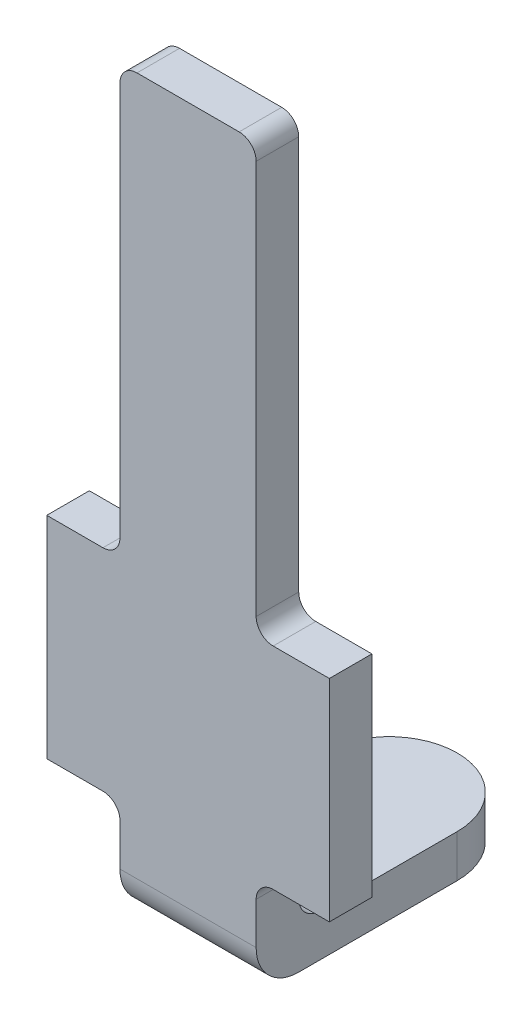
ISO-10303-21;
HEADER;
FILE_DESCRIPTION(('STEP AP214'),'2;1');
FILE_NAME('part.step','',(''),(''),'','','');
FILE_SCHEMA(('AUTOMOTIVE_DESIGN { 1 0 10303 214 1 1 1 1 }'));
ENDSEC;
DATA;
#1=APPLICATION_CONTEXT('core data for automotive mechanical design processes');
#2=APPLICATION_PROTOCOL_DEFINITION('international standard','automotive_design',2000,#1);
#3=PRODUCT_CONTEXT('',#1,'mechanical');
#4=PRODUCT('Part','Part','',(#3));
#5=PRODUCT_RELATED_PRODUCT_CATEGORY('part','',(#4));
#6=PRODUCT_DEFINITION_FORMATION('','',#4);
#7=PRODUCT_DEFINITION_CONTEXT('part definition',#1,'design');
#8=PRODUCT_DEFINITION('design','',#6,#7);
#9=PRODUCT_DEFINITION_SHAPE('','',#8);
#10=(LENGTH_UNIT() NAMED_UNIT(*) SI_UNIT(.MILLI.,.METRE.));
#11=(NAMED_UNIT(*) PLANE_ANGLE_UNIT() SI_UNIT($,.RADIAN.));
#12=(NAMED_UNIT(*) SI_UNIT($,.STERADIAN.) SOLID_ANGLE_UNIT());
#13=UNCERTAINTY_MEASURE_WITH_UNIT(LENGTH_MEASURE(1.E-05),#10,'distance_accuracy_value','');
#14=(GEOMETRIC_REPRESENTATION_CONTEXT(3) GLOBAL_UNCERTAINTY_ASSIGNED_CONTEXT((#13)) GLOBAL_UNIT_ASSIGNED_CONTEXT((#10,
#11,#12)) REPRESENTATION_CONTEXT('',''));
#15=CARTESIAN_POINT('',(0.,0.,0.));
#16=DIRECTION('',(0.,0.,1.));
#17=DIRECTION('',(1.,0.,0.));
#18=AXIS2_PLACEMENT_3D('',#15,#16,#17);
#19=CARTESIAN_POINT('',(-4.31,1.48437551370885,-0.748999999999983));
#20=DIRECTION('',(0.,0.,-1.));
#21=DIRECTION('',(1.,0.,0.));
#22=AXIS2_PLACEMENT_3D('',#19,#20,#21);
#23=CYLINDRICAL_SURFACE('',#22,0.1);
#24=CARTESIAN_POINT('',(-4.31,1.48437551370885,-0.498999999999983));
#25=DIRECTION('',(0.,0.,1.));
#26=DIRECTION('',(1.,0.,0.));
#27=AXIS2_PLACEMENT_3D('',#24,#25,#26);
#28=CIRCLE('',#27,0.1);
#29=CARTESIAN_POINT('',(-4.31,1.38437551370885,-0.499000000000012));
#30=VERTEX_POINT('',#29);
#31=CARTESIAN_POINT('',(-4.21,1.48437551370885,-0.498999999999983));
#32=VERTEX_POINT('',#31);
#33=EDGE_CURVE('E337',#30,#32,#28,.T.);
#34=ORIENTED_EDGE('',*,*,#33,.T.);
#35=DIRECTION('',(0.,0.,-1.));
#36=VECTOR('',#35,1.);
#37=CARTESIAN_POINT('',(-4.21,1.48437551370885,-0.748999999999983));
#38=LINE('',#37,#36);
#39=CARTESIAN_POINT('',(-4.21,1.48437551370885,-0.748999999999983));
#40=VERTEX_POINT('',#39);
#41=EDGE_CURVE('E292',#32,#40,#38,.T.);
#42=ORIENTED_EDGE('',*,*,#41,.T.);
#43=CARTESIAN_POINT('',(-4.31,1.48437551370885,-0.748999999999983));
#44=DIRECTION('',(0.,0.,-1.));
#45=DIRECTION('',(-1.,0.,0.));
#46=AXIS2_PLACEMENT_3D('',#43,#44,#45);
#47=CIRCLE('',#46,0.1);
#48=CARTESIAN_POINT('',(-4.31,1.38437551370885,-0.749000000000012));
#49=VERTEX_POINT('',#48);
#50=EDGE_CURVE('E307',#40,#49,#47,.T.);
#51=ORIENTED_EDGE('',*,*,#50,.T.);
#52=DIRECTION('',(0.,0.,1.));
#53=VECTOR('',#52,1.);
#54=CARTESIAN_POINT('',(-4.31,1.38437551370885,-0.749000000000012));
#55=LINE('',#54,#53);
#56=EDGE_CURVE('E322',#49,#30,#55,.T.);
#57=ORIENTED_EDGE('',*,*,#56,.T.);
#58=EDGE_LOOP('',(#34,#42,#51,#57));
#59=FACE_BOUND('',#58,.T.);
#60=ADVANCED_FACE('F17',(#59),#23,.F.);
#61=CARTESIAN_POINT('',(-3.31,1.48437551370885,-0.749000000000014));
#62=DIRECTION('',(0.,0.,1.));
#63=DIRECTION('',(-1.,0.,0.));
#64=AXIS2_PLACEMENT_3D('',#61,#62,#63);
#65=CYLINDRICAL_SURFACE('',#64,0.1);
#66=CARTESIAN_POINT('',(-3.31,1.48437551370885,-0.498999999999985));
#67=DIRECTION('',(0.,0.,1.));
#68=DIRECTION('',(1.,0.,0.));
#69=AXIS2_PLACEMENT_3D('',#66,#67,#68);
#70=CIRCLE('',#69,0.1);
#71=CARTESIAN_POINT('',(-3.41,1.48437551370885,-0.498999999999984));
#72=VERTEX_POINT('',#71);
#73=CARTESIAN_POINT('',(-3.31,1.38437551370885,-0.499000000000013));
#74=VERTEX_POINT('',#73);
#75=EDGE_CURVE('E248',#72,#74,#70,.T.);
#76=ORIENTED_EDGE('',*,*,#75,.T.);
#77=DIRECTION('',(0.,0.,-1.));
#78=VECTOR('',#77,1.);
#79=CARTESIAN_POINT('',(-3.31,1.38437551370885,-0.748999999999984));
#80=LINE('',#79,#78);
#81=CARTESIAN_POINT('',(-3.31,1.38437551370885,-0.749000000000014));
#82=VERTEX_POINT('',#81);
#83=EDGE_CURVE('E43',#74,#82,#80,.T.);
#84=ORIENTED_EDGE('',*,*,#83,.T.);
#85=CARTESIAN_POINT('',(-3.31,1.48437551370885,-0.748999999999984));
#86=DIRECTION('',(0.,0.,-1.));
#87=DIRECTION('',(-1.,0.,0.));
#88=AXIS2_PLACEMENT_3D('',#85,#86,#87);
#89=CIRCLE('',#88,0.1);
#90=CARTESIAN_POINT('',(-3.41,1.48437551370885,-0.748999999999984));
#91=VERTEX_POINT('',#90);
#92=EDGE_CURVE('E302',#82,#91,#89,.T.);
#93=ORIENTED_EDGE('',*,*,#92,.T.);
#94=DIRECTION('',(0.,0.,1.));
#95=VECTOR('',#94,1.);
#96=CARTESIAN_POINT('',(-3.41,1.48437551370885,-0.498999999999984));
#97=LINE('',#96,#95);
#98=EDGE_CURVE('E336',#91,#72,#97,.T.);
#99=ORIENTED_EDGE('',*,*,#98,.T.);
#100=EDGE_LOOP('',(#76,#84,#93,#99));
#101=FACE_BOUND('',#100,.T.);
#102=ADVANCED_FACE('F499',(#101),#65,.F.);
#103=CARTESIAN_POINT('',(-4.31,0.0459658151929143,-0.749000000000012));
#104=DIRECTION('',(0.,0.,1.));
#105=DIRECTION('',(-1.,0.,0.));
#106=AXIS2_PLACEMENT_3D('',#103,#104,#105);
#107=CYLINDRICAL_SURFACE('',#106,0.1);
#108=CARTESIAN_POINT('',(-4.31,0.0459658151929143,-0.498999999999983));
#109=DIRECTION('',(0.,0.,1.));
#110=DIRECTION('',(1.,0.,0.));
#111=AXIS2_PLACEMENT_3D('',#108,#109,#110);
#112=CIRCLE('',#111,0.1);
#113=CARTESIAN_POINT('',(-4.21,0.0459658151929143,-0.498999999999983));
#114=VERTEX_POINT('',#113);
#115=CARTESIAN_POINT('',(-4.31,0.145965815192914,-0.499000000000012));
#116=VERTEX_POINT('',#115);
#117=EDGE_CURVE('E265',#114,#116,#112,.T.);
#118=ORIENTED_EDGE('',*,*,#117,.T.);
#119=DIRECTION('',(0.,0.,-1.));
#120=VECTOR('',#119,1.);
#121=CARTESIAN_POINT('',(-4.31,0.145965815192914,-0.748999999999983));
#122=LINE('',#121,#120);
#123=CARTESIAN_POINT('',(-4.31,0.145965815192914,-0.749000000000012));
#124=VERTEX_POINT('',#123);
#125=EDGE_CURVE('E325',#116,#124,#122,.T.);
#126=ORIENTED_EDGE('',*,*,#125,.T.);
#127=CARTESIAN_POINT('',(-4.31,0.0459658151929143,-0.748999999999983));
#128=DIRECTION('',(0.,0.,-1.));
#129=DIRECTION('',(-1.,0.,0.));
#130=AXIS2_PLACEMENT_3D('',#127,#128,#129);
#131=CIRCLE('',#130,0.1);
#132=CARTESIAN_POINT('',(-4.21,0.0459658151929143,-0.748999999999983));
#133=VERTEX_POINT('',#132);
#134=EDGE_CURVE('E293',#124,#133,#131,.T.);
#135=ORIENTED_EDGE('',*,*,#134,.T.);
#136=DIRECTION('',(0.,0.,1.));
#137=VECTOR('',#136,1.);
#138=CARTESIAN_POINT('',(-4.21,0.0459658151929143,-0.499000000000012));
#139=LINE('',#138,#137);
#140=EDGE_CURVE('E255',#133,#114,#139,.T.);
#141=ORIENTED_EDGE('',*,*,#140,.T.);
#142=EDGE_LOOP('',(#118,#126,#135,#141));
#143=FACE_BOUND('',#142,.T.);
#144=ADVANCED_FACE('F700',(#143),#107,.F.);
#145=CARTESIAN_POINT('',(-3.31,0.0459658151929143,-0.748999999999984));
#146=DIRECTION('',(0.,0.,-1.));
#147=DIRECTION('',(1.,0.,0.));
#148=AXIS2_PLACEMENT_3D('',#145,#146,#147);
#149=CYLINDRICAL_SURFACE('',#148,0.1);
#150=CARTESIAN_POINT('',(-3.31,0.0459658151929143,-0.498999999999984));
#151=DIRECTION('',(0.,0.,1.));
#152=DIRECTION('',(1.,0.,0.));
#153=AXIS2_PLACEMENT_3D('',#150,#151,#152);
#154=CIRCLE('',#153,0.1);
#155=CARTESIAN_POINT('',(-3.31,0.145965815192914,-0.499000000000013));
#156=VERTEX_POINT('',#155);
#157=CARTESIAN_POINT('',(-3.41,0.0459658151929143,-0.498999999999984));
#158=VERTEX_POINT('',#157);
#159=EDGE_CURVE('E218',#156,#158,#154,.T.);
#160=ORIENTED_EDGE('',*,*,#159,.T.);
#161=DIRECTION('',(0.,0.,-1.));
#162=VECTOR('',#161,1.);
#163=CARTESIAN_POINT('',(-3.41,0.0459658151929143,-0.748999999999984));
#164=LINE('',#163,#162);
#165=CARTESIAN_POINT('',(-3.41,0.0459658151929143,-0.748999999999984));
#166=VERTEX_POINT('',#165);
#167=EDGE_CURVE('E213',#158,#166,#164,.T.);
#168=ORIENTED_EDGE('',*,*,#167,.T.);
#169=CARTESIAN_POINT('',(-3.31,0.0459658151929143,-0.748999999999984));
#170=DIRECTION('',(0.,0.,-1.));
#171=DIRECTION('',(-1.,0.,0.));
#172=AXIS2_PLACEMENT_3D('',#169,#170,#171);
#173=CIRCLE('',#172,0.1);
#174=CARTESIAN_POINT('',(-3.31,0.145965815192914,-0.749000000000013));
#175=VERTEX_POINT('',#174);
#176=EDGE_CURVE('E396',#166,#175,#173,.T.);
#177=ORIENTED_EDGE('',*,*,#176,.T.);
#178=DIRECTION('',(0.,0.,1.));
#179=VECTOR('',#178,1.);
#180=CARTESIAN_POINT('',(-3.31,0.145965815192914,-0.749000000000013));
#181=LINE('',#180,#179);
#182=EDGE_CURVE('E11',#175,#156,#181,.T.);
#183=ORIENTED_EDGE('',*,*,#182,.T.);
#184=EDGE_LOOP('',(#160,#168,#177,#183));
#185=FACE_BOUND('',#184,.T.);
#186=ADVANCED_FACE('F488',(#185),#149,.F.);
#187=CARTESIAN_POINT('',(-4.11,3.8,-0.748999999999983));
#188=DIRECTION('',(0.,0.,1.));
#189=DIRECTION('',(-1.,0.,0.));
#190=AXIS2_PLACEMENT_3D('',#187,#188,#189);
#191=CYLINDRICAL_SURFACE('',#190,0.1);
#192=CARTESIAN_POINT('',(-4.11,3.8,-0.498999999999984));
#193=DIRECTION('',(0.,0.,-1.));
#194=DIRECTION('',(1.,0.,0.));
#195=AXIS2_PLACEMENT_3D('',#192,#193,#194);
#196=CIRCLE('',#195,0.1);
#197=CARTESIAN_POINT('',(-4.21,3.8,-0.498999999999984));
#198=VERTEX_POINT('',#197);
#199=CARTESIAN_POINT('',(-4.11,3.9,-0.498999999999984));
#200=VERTEX_POINT('',#199);
#201=EDGE_CURVE('E230',#198,#200,#196,.T.);
#202=ORIENTED_EDGE('',*,*,#201,.T.);
#203=DIRECTION('',(0.,0.,-1.));
#204=VECTOR('',#203,1.);
#205=CARTESIAN_POINT('',(-4.11,3.9,-0.748999999999983));
#206=LINE('',#205,#204);
#207=CARTESIAN_POINT('',(-4.11,3.9,-0.748999999999983));
#208=VERTEX_POINT('',#207);
#209=EDGE_CURVE('E380',#200,#208,#206,.T.);
#210=ORIENTED_EDGE('',*,*,#209,.T.);
#211=CARTESIAN_POINT('',(-4.11,3.8,-0.748999999999983));
#212=DIRECTION('',(0.,0.,1.));
#213=DIRECTION('',(-1.,0.,0.));
#214=AXIS2_PLACEMENT_3D('',#211,#212,#213);
#215=CIRCLE('',#214,0.1);
#216=CARTESIAN_POINT('',(-4.21,3.8,-0.748999999999983));
#217=VERTEX_POINT('',#216);
#218=EDGE_CURVE('E271',#208,#217,#215,.T.);
#219=ORIENTED_EDGE('',*,*,#218,.T.);
#220=DIRECTION('',(0.,0.,1.));
#221=VECTOR('',#220,1.);
#222=CARTESIAN_POINT('',(-4.21,3.8,-0.498999999999984));
#223=LINE('',#222,#221);
#224=EDGE_CURVE('E21',#217,#198,#223,.T.);
#225=ORIENTED_EDGE('',*,*,#224,.T.);
#226=EDGE_LOOP('',(#202,#210,#219,#225));
#227=FACE_BOUND('',#226,.T.);
#228=ADVANCED_FACE('F515',(#227),#191,.T.);
#229=CARTESIAN_POINT('',(-3.51,3.8,-0.748999999999984));
#230=DIRECTION('',(0.,0.,-1.));
#231=DIRECTION('',(1.,0.,0.));
#232=AXIS2_PLACEMENT_3D('',#229,#230,#231);
#233=CYLINDRICAL_SURFACE('',#232,0.1);
#234=CARTESIAN_POINT('',(-3.51,3.8,-0.498999999999985));
#235=DIRECTION('',(0.,0.,-1.));
#236=DIRECTION('',(1.,0.,0.));
#237=AXIS2_PLACEMENT_3D('',#234,#235,#236);
#238=CIRCLE('',#237,0.1);
#239=CARTESIAN_POINT('',(-3.51,3.9,-0.498999999999985));
#240=VERTEX_POINT('',#239);
#241=CARTESIAN_POINT('',(-3.41,3.8,-0.498999999999985));
#242=VERTEX_POINT('',#241);
#243=EDGE_CURVE('E327',#240,#242,#238,.T.);
#244=ORIENTED_EDGE('',*,*,#243,.T.);
#245=DIRECTION('',(0.,0.,-1.));
#246=VECTOR('',#245,1.);
#247=CARTESIAN_POINT('',(-3.41,3.8,-0.748999999999984));
#248=LINE('',#247,#246);
#249=CARTESIAN_POINT('',(-3.41,3.8,-0.748999999999984));
#250=VERTEX_POINT('',#249);
#251=EDGE_CURVE('E317',#242,#250,#248,.T.);
#252=ORIENTED_EDGE('',*,*,#251,.T.);
#253=CARTESIAN_POINT('',(-3.51,3.8,-0.748999999999984));
#254=DIRECTION('',(0.,0.,1.));
#255=DIRECTION('',(-1.,0.,0.));
#256=AXIS2_PLACEMENT_3D('',#253,#254,#255);
#257=CIRCLE('',#256,0.1);
#258=CARTESIAN_POINT('',(-3.51,3.9,-0.748999999999984));
#259=VERTEX_POINT('',#258);
#260=EDGE_CURVE('E266',#250,#259,#257,.T.);
#261=ORIENTED_EDGE('',*,*,#260,.T.);
#262=DIRECTION('',(0.,0.,1.));
#263=VECTOR('',#262,1.);
#264=CARTESIAN_POINT('',(-3.51,3.9,-0.748999999999984));
#265=LINE('',#264,#263);
#266=EDGE_CURVE('E299',#259,#240,#265,.T.);
#267=ORIENTED_EDGE('',*,*,#266,.T.);
#268=EDGE_LOOP('',(#244,#252,#261,#267));
#269=FACE_BOUND('',#268,.T.);
#270=ADVANCED_FACE('F505',(#269),#233,.T.);
#271=CARTESIAN_POINT('',(-2.98,0.,-1.00308650274883E-13));
#272=DIRECTION('',(-1.,0.,0.));
#273=DIRECTION('',(0.,1.,0.));
#274=AXIS2_PLACEMENT_3D('',#271,#272,#273);
#275=PLANE('',#274);
#276=DIRECTION('',(0.,0.,1.));
#277=VECTOR('',#276,1.);
#278=CARTESIAN_POINT('',(-2.98,1.38437551370885,-0.749000000000014));
#279=LINE('',#278,#277);
#280=CARTESIAN_POINT('',(-2.98,1.38437551370885,-0.749000000000014));
#281=VERTEX_POINT('',#280);
#282=CARTESIAN_POINT('',(-2.98,1.38437551370885,-0.499000000000014));
#283=VERTEX_POINT('',#282);
#284=EDGE_CURVE('E324',#281,#283,#279,.T.);
#285=ORIENTED_EDGE('',*,*,#284,.T.);
#286=DIRECTION('',(0.,-1.,0.));
#287=VECTOR('',#286,1.);
#288=CARTESIAN_POINT('',(-2.98,1.38437551370885,-0.499000000000014));
#289=LINE('',#288,#287);
#290=CARTESIAN_POINT('',(-2.98,0.145965815192914,-0.499000000000014));
#291=VERTEX_POINT('',#290);
#292=EDGE_CURVE('E348',#283,#291,#289,.T.);
#293=ORIENTED_EDGE('',*,*,#292,.T.);
#294=DIRECTION('',(0.,0.,1.));
#295=VECTOR('',#294,1.);
#296=CARTESIAN_POINT('',(-2.98,0.145965815192914,-0.749000000000014));
#297=LINE('',#296,#295);
#298=CARTESIAN_POINT('',(-2.98,0.145965815192914,-0.749000000000014));
#299=VERTEX_POINT('',#298);
#300=EDGE_CURVE('E28',#299,#291,#297,.T.);
#301=ORIENTED_EDGE('',*,*,#300,.F.);
#302=DIRECTION('',(0.,-1.,0.));
#303=VECTOR('',#302,1.);
#304=CARTESIAN_POINT('',(-2.98,1.38437551370885,-0.749000000000014));
#305=LINE('',#304,#303);
#306=EDGE_CURVE('E276',#281,#299,#305,.T.);
#307=ORIENTED_EDGE('',*,*,#306,.F.);
#308=EDGE_LOOP('',(#285,#293,#301,#307));
#309=FACE_BOUND('',#308,.T.);
#310=ADVANCED_FACE('F19',(#309),#275,.F.);
#311=CARTESIAN_POINT('',(-4.64,0.145965815192914,-0.749000000000011));
#312=DIRECTION('',(0.,-1.,0.));
#313=DIRECTION('',(0.,0.,-1.));
#314=AXIS2_PLACEMENT_3D('',#311,#312,#313);
#315=PLANE('',#314);
#316=DIRECTION('',(1.,0.,0.));
#317=VECTOR('',#316,1.);
#318=CARTESIAN_POINT('',(-4.64,0.145965815192914,-0.749000000000011));
#319=LINE('',#318,#317);
#320=EDGE_CURVE('E280',#175,#299,#319,.T.);
#321=ORIENTED_EDGE('',*,*,#320,.T.);
#322=ORIENTED_EDGE('',*,*,#300,.T.);
#323=DIRECTION('',(1.,0.,0.));
#324=VECTOR('',#323,1.);
#325=CARTESIAN_POINT('',(-4.64,0.145965815192914,-0.499000000000011));
#326=LINE('',#325,#324);
#327=EDGE_CURVE('E353',#156,#291,#326,.T.);
#328=ORIENTED_EDGE('',*,*,#327,.F.);
#329=ORIENTED_EDGE('',*,*,#182,.F.);
#330=EDGE_LOOP('',(#321,#322,#328,#329));
#331=FACE_BOUND('',#330,.T.);
#332=ADVANCED_FACE('F493',(#331),#315,.T.);
#333=CARTESIAN_POINT('',(-4.64,1.38437551370885,-0.749000000000012));
#334=DIRECTION('',(0.,-1.,0.));
#335=DIRECTION('',(0.,0.,-1.));
#336=AXIS2_PLACEMENT_3D('',#333,#334,#335);
#337=PLANE('',#336);
#338=DIRECTION('',(1.,0.,0.));
#339=VECTOR('',#338,1.);
#340=CARTESIAN_POINT('',(-4.64,1.38437551370885,-0.499000000000011));
#341=LINE('',#340,#339);
#342=EDGE_CURVE('E352',#74,#283,#341,.T.);
#343=ORIENTED_EDGE('',*,*,#342,.T.);
#344=ORIENTED_EDGE('',*,*,#284,.F.);
#345=DIRECTION('',(1.,0.,0.));
#346=VECTOR('',#345,1.);
#347=CARTESIAN_POINT('',(-4.64,1.38437551370885,-0.749000000000012));
#348=LINE('',#347,#346);
#349=EDGE_CURVE('E281',#82,#281,#348,.T.);
#350=ORIENTED_EDGE('',*,*,#349,.F.);
#351=ORIENTED_EDGE('',*,*,#83,.F.);
#352=EDGE_LOOP('',(#343,#344,#350,#351));
#353=FACE_BOUND('',#352,.T.);
#354=ADVANCED_FACE('F496',(#353),#337,.F.);
#355=CARTESIAN_POINT('',(-4.64,1.38437551370885,-0.749000000000012));
#356=DIRECTION('',(0.,-1.,0.));
#357=DIRECTION('',(0.,0.,-1.));
#358=AXIS2_PLACEMENT_3D('',#355,#356,#357);
#359=PLANE('',#358);
#360=DIRECTION('',(1.,0.,0.));
#361=VECTOR('',#360,1.);
#362=CARTESIAN_POINT('',(-4.64,1.38437551370885,-0.749000000000012));
#363=LINE('',#362,#361);
#364=CARTESIAN_POINT('',(-4.64,1.38437551370885,-0.749000000000012));
#365=VERTEX_POINT('',#364);
#366=EDGE_CURVE('E365',#365,#49,#363,.T.);
#367=ORIENTED_EDGE('',*,*,#366,.F.);
#368=DIRECTION('',(0.,0.,1.));
#369=VECTOR('',#368,1.);
#370=CARTESIAN_POINT('',(-4.64,1.38437551370885,-0.749000000000012));
#371=LINE('',#370,#369);
#372=CARTESIAN_POINT('',(-4.64,1.38437551370885,-0.499000000000011));
#373=VERTEX_POINT('',#372);
#374=EDGE_CURVE('E258',#365,#373,#371,.T.);
#375=ORIENTED_EDGE('',*,*,#374,.T.);
#376=DIRECTION('',(1.,0.,0.));
#377=VECTOR('',#376,1.);
#378=CARTESIAN_POINT('',(-4.64,1.38437551370885,-0.499000000000011));
#379=LINE('',#378,#377);
#380=EDGE_CURVE('E312',#373,#30,#379,.T.);
#381=ORIENTED_EDGE('',*,*,#380,.T.);
#382=ORIENTED_EDGE('',*,*,#56,.F.);
#383=EDGE_LOOP('',(#367,#375,#381,#382));
#384=FACE_BOUND('',#383,.T.);
#385=ADVANCED_FACE('F753',(#384),#359,.F.);
#386=CARTESIAN_POINT('',(-4.64,0.145965815192914,-0.749000000000011));
#387=DIRECTION('',(0.,-1.,0.));
#388=DIRECTION('',(0.,0.,-1.));
#389=AXIS2_PLACEMENT_3D('',#386,#387,#388);
#390=PLANE('',#389);
#391=DIRECTION('',(1.,0.,0.));
#392=VECTOR('',#391,1.);
#393=CARTESIAN_POINT('',(-4.64,0.145965815192914,-0.499000000000011));
#394=LINE('',#393,#392);
#395=CARTESIAN_POINT('',(-4.64,0.145965815192914,-0.499000000000011));
#396=VERTEX_POINT('',#395);
#397=EDGE_CURVE('E275',#396,#116,#394,.T.);
#398=ORIENTED_EDGE('',*,*,#397,.F.);
#399=DIRECTION('',(0.,0.,1.));
#400=VECTOR('',#399,1.);
#401=CARTESIAN_POINT('',(-4.64,0.145965815192914,-0.749000000000011));
#402=LINE('',#401,#400);
#403=CARTESIAN_POINT('',(-4.64,0.145965815192914,-0.749000000000011));
#404=VERTEX_POINT('',#403);
#405=EDGE_CURVE('E262',#404,#396,#402,.T.);
#406=ORIENTED_EDGE('',*,*,#405,.F.);
#407=DIRECTION('',(1.,0.,0.));
#408=VECTOR('',#407,1.);
#409=CARTESIAN_POINT('',(-4.64,0.145965815192914,-0.749000000000011));
#410=LINE('',#409,#408);
#411=EDGE_CURVE('E297',#404,#124,#410,.T.);
#412=ORIENTED_EDGE('',*,*,#411,.T.);
#413=ORIENTED_EDGE('',*,*,#125,.F.);
#414=EDGE_LOOP('',(#398,#406,#412,#413));
#415=FACE_BOUND('',#414,.T.);
#416=ADVANCED_FACE('F739',(#415),#390,.T.);
#417=CARTESIAN_POINT('',(-4.64,0.,0.));
#418=DIRECTION('',(-1.,0.,0.));
#419=DIRECTION('',(0.,1.,0.));
#420=AXIS2_PLACEMENT_3D('',#417,#418,#419);
#421=PLANE('',#420);
#422=ORIENTED_EDGE('',*,*,#374,.F.);
#423=DIRECTION('',(0.,-1.,0.));
#424=VECTOR('',#423,1.);
#425=CARTESIAN_POINT('',(-4.64,1.38437551370885,-0.749000000000012));
#426=LINE('',#425,#424);
#427=EDGE_CURVE('E361',#365,#404,#426,.T.);
#428=ORIENTED_EDGE('',*,*,#427,.T.);
#429=ORIENTED_EDGE('',*,*,#405,.T.);
#430=DIRECTION('',(0.,-1.,0.));
#431=VECTOR('',#430,1.);
#432=CARTESIAN_POINT('',(-4.64,1.38437551370885,-0.499000000000011));
#433=LINE('',#432,#431);
#434=EDGE_CURVE('E308',#373,#396,#433,.T.);
#435=ORIENTED_EDGE('',*,*,#434,.F.);
#436=EDGE_LOOP('',(#422,#428,#429,#435));
#437=FACE_BOUND('',#436,.T.);
#438=ADVANCED_FACE('F734',(#437),#421,.T.);
#439=CARTESIAN_POINT('',(-3.81,-0.2,-1.68));
#440=DIRECTION('',(0.,-1.,0.));
#441=DIRECTION('',(0.,0.,1.));
#442=AXIS2_PLACEMENT_3D('',#439,#440,#441);
#443=CYLINDRICAL_SURFACE('',#442,0.4);
#444=DIRECTION('',(0.,-1.,0.));
#445=VECTOR('',#444,1.);
#446=CARTESIAN_POINT('',(-3.41,-0.2,-1.68));
#447=LINE('',#446,#445);
#448=CARTESIAN_POINT('',(-3.41,-0.2,-1.68));
#449=VERTEX_POINT('',#448);
#450=CARTESIAN_POINT('',(-3.41,-0.45,-1.68));
#451=VERTEX_POINT('',#450);
#452=EDGE_CURVE('E331',#449,#451,#447,.T.);
#453=ORIENTED_EDGE('',*,*,#452,.T.);
#454=CARTESIAN_POINT('',(-3.81,-0.45,-1.68));
#455=DIRECTION('',(0.,1.,0.));
#456=DIRECTION('',(0.,0.,-1.));
#457=AXIS2_PLACEMENT_3D('',#454,#455,#456);
#458=CIRCLE('',#457,0.4);
#459=CARTESIAN_POINT('',(-4.21,-0.45,-1.68));
#460=VERTEX_POINT('',#459);
#461=EDGE_CURVE('E253',#451,#460,#458,.T.);
#462=ORIENTED_EDGE('',*,*,#461,.T.);
#463=DIRECTION('',(0.,1.,0.));
#464=VECTOR('',#463,1.);
#465=CARTESIAN_POINT('',(-4.21,-0.2,-1.68));
#466=LINE('',#465,#464);
#467=CARTESIAN_POINT('',(-4.21,-0.2,-1.68));
#468=VERTEX_POINT('',#467);
#469=EDGE_CURVE('E259',#460,#468,#466,.T.);
#470=ORIENTED_EDGE('',*,*,#469,.T.);
#471=CARTESIAN_POINT('',(-3.81,-0.2,-1.68));
#472=DIRECTION('',(0.,-1.,0.));
#473=DIRECTION('',(0.,0.,1.));
#474=AXIS2_PLACEMENT_3D('',#471,#472,#473);
#475=CIRCLE('',#474,0.4);
#476=EDGE_CURVE('E250',#468,#449,#475,.T.);
#477=ORIENTED_EDGE('',*,*,#476,.T.);
#478=EDGE_LOOP('',(#453,#462,#470,#477));
#479=FACE_BOUND('',#478,.T.);
#480=ADVANCED_FACE('F738',(#479),#443,.T.);
#481=CARTESIAN_POINT('',(-4.21,-0.2,-0.748999999999983));
#482=DIRECTION('',(-1.,0.,0.));
#483=DIRECTION('',(0.,1.,0.));
#484=AXIS2_PLACEMENT_3D('',#481,#482,#483);
#485=PLANE('',#484);
#486=DIRECTION('',(0.,-1.,0.));
#487=VECTOR('',#486,1.);
#488=CARTESIAN_POINT('',(-4.21,3.9,-0.748999999999983));
#489=LINE('',#488,#487);
#490=CARTESIAN_POINT('',(-4.21,-0.0749999999999988,-0.748999999999983));
#491=VERTEX_POINT('',#490);
#492=EDGE_CURVE('E298',#133,#491,#489,.T.);
#493=ORIENTED_EDGE('',*,*,#492,.T.);
#494=CARTESIAN_POINT('',(-4.21,-0.0749999999999988,-0.873999999999983));
#495=DIRECTION('',(1.,0.,0.));
#496=DIRECTION('',(0.,0.,-1.));
#497=AXIS2_PLACEMENT_3D('',#494,#495,#496);
#498=CIRCLE('',#497,0.125);
#499=CARTESIAN_POINT('',(-4.21,-0.2,-0.873999999999983));
#500=VERTEX_POINT('',#499);
#501=EDGE_CURVE('E270',#491,#500,#498,.T.);
#502=ORIENTED_EDGE('',*,*,#501,.T.);
#503=DIRECTION('',(0.,0.,-1.));
#504=VECTOR('',#503,1.);
#505=CARTESIAN_POINT('',(-4.21,-0.2,-0.873999999999983));
#506=LINE('',#505,#504);
#507=EDGE_CURVE('E388',#500,#468,#506,.T.);
#508=ORIENTED_EDGE('',*,*,#507,.T.);
#509=ORIENTED_EDGE('',*,*,#469,.F.);
#510=DIRECTION('',(0.,0.,1.));
#511=VECTOR('',#510,1.);
#512=CARTESIAN_POINT('',(-4.21,-0.45,-0.748999999999983));
#513=LINE('',#512,#511);
#514=CARTESIAN_POINT('',(-4.21,-0.45,-0.748999999999983));
#515=VERTEX_POINT('',#514);
#516=EDGE_CURVE('E244',#460,#515,#513,.T.);
#517=ORIENTED_EDGE('',*,*,#516,.T.);
#518=CARTESIAN_POINT('',(-4.21,-0.2,-0.748999999999983));
#519=DIRECTION('',(-1.,0.,0.));
#520=DIRECTION('',(0.,0.,-1.));
#521=AXIS2_PLACEMENT_3D('',#518,#519,#520);
#522=CIRCLE('',#521,0.25);
#523=CARTESIAN_POINT('',(-4.21,-0.2,-0.498999999999983));
#524=VERTEX_POINT('',#523);
#525=EDGE_CURVE('E237',#515,#524,#522,.T.);
#526=ORIENTED_EDGE('',*,*,#525,.T.);
#527=DIRECTION('',(0.,1.,0.));
#528=VECTOR('',#527,1.);
#529=CARTESIAN_POINT('',(-4.21,3.9,-0.498999999999984));
#530=LINE('',#529,#528);
#531=EDGE_CURVE('E219',#524,#114,#530,.T.);
#532=ORIENTED_EDGE('',*,*,#531,.T.);
#533=ORIENTED_EDGE('',*,*,#140,.F.);
#534=EDGE_LOOP('',(#493,#502,#508,#509,#517,#526,#532,#533));
#535=FACE_BOUND('',#534,.T.);
#536=ADVANCED_FACE('F481',(#535),#485,.T.);
#537=CARTESIAN_POINT('',(-3.41,-0.2,-0.748999999999984));
#538=DIRECTION('',(-1.,0.,0.));
#539=DIRECTION('',(0.,1.,0.));
#540=AXIS2_PLACEMENT_3D('',#537,#538,#539);
#541=PLANE('',#540);
#542=DIRECTION('',(0.,1.,0.));
#543=VECTOR('',#542,1.);
#544=CARTESIAN_POINT('',(-3.41,3.9,-0.498999999999985));
#545=LINE('',#544,#543);
#546=CARTESIAN_POINT('',(-3.41,-0.2,-0.498999999999984));
#547=VERTEX_POINT('',#546);
#548=EDGE_CURVE('E205',#547,#158,#545,.T.);
#549=ORIENTED_EDGE('',*,*,#548,.F.);
#550=CARTESIAN_POINT('',(-3.41,-0.2,-0.748999999999984));
#551=DIRECTION('',(-1.,0.,0.));
#552=DIRECTION('',(0.,0.,-1.));
#553=AXIS2_PLACEMENT_3D('',#550,#551,#552);
#554=CIRCLE('',#553,0.25);
#555=CARTESIAN_POINT('',(-3.41,-0.45,-0.748999999999984));
#556=VERTEX_POINT('',#555);
#557=EDGE_CURVE('E210',#556,#547,#554,.T.);
#558=ORIENTED_EDGE('',*,*,#557,.F.);
#559=DIRECTION('',(0.,0.,1.));
#560=VECTOR('',#559,1.);
#561=CARTESIAN_POINT('',(-3.41,-0.45,-0.748999999999984));
#562=LINE('',#561,#560);
#563=EDGE_CURVE('E287',#451,#556,#562,.T.);
#564=ORIENTED_EDGE('',*,*,#563,.F.);
#565=ORIENTED_EDGE('',*,*,#452,.F.);
#566=DIRECTION('',(0.,0.,-1.));
#567=VECTOR('',#566,1.);
#568=CARTESIAN_POINT('',(-3.41,-0.2,-0.873999999999984));
#569=LINE('',#568,#567);
#570=CARTESIAN_POINT('',(-3.41,-0.2,-0.873999999999984));
#571=VERTEX_POINT('',#570);
#572=EDGE_CURVE('E254',#571,#449,#569,.T.);
#573=ORIENTED_EDGE('',*,*,#572,.F.);
#574=CARTESIAN_POINT('',(-3.41,-0.0749999999999988,-0.873999999999984));
#575=DIRECTION('',(1.,0.,0.));
#576=DIRECTION('',(0.,0.,-1.));
#577=AXIS2_PLACEMENT_3D('',#574,#575,#576);
#578=CIRCLE('',#577,0.125);
#579=CARTESIAN_POINT('',(-3.41,-0.0749999999999988,-0.748999999999984));
#580=VERTEX_POINT('',#579);
#581=EDGE_CURVE('E321',#580,#571,#578,.T.);
#582=ORIENTED_EDGE('',*,*,#581,.F.);
#583=DIRECTION('',(0.,-1.,0.));
#584=VECTOR('',#583,1.);
#585=CARTESIAN_POINT('',(-3.41,3.9,-0.748999999999984));
#586=LINE('',#585,#584);
#587=EDGE_CURVE('E370',#166,#580,#586,.T.);
#588=ORIENTED_EDGE('',*,*,#587,.F.);
#589=ORIENTED_EDGE('',*,*,#167,.F.);
#590=EDGE_LOOP('',(#549,#558,#564,#565,#573,#582,#588,#589));
#591=FACE_BOUND('',#590,.T.);
#592=ADVANCED_FACE('F207',(#591),#541,.F.);
#593=CARTESIAN_POINT('',(-3.41,3.9,-0.498999999999985));
#594=DIRECTION('',(0.,0.,-1.));
#595=DIRECTION('',(-1.,0.,0.));
#596=AXIS2_PLACEMENT_3D('',#593,#594,#595);
#597=PLANE('',#596);
#598=DIRECTION('',(-1.,0.,0.));
#599=VECTOR('',#598,1.);
#600=CARTESIAN_POINT('',(-3.41,3.9,-0.498999999999985));
#601=LINE('',#600,#599);
#602=EDGE_CURVE('E303',#240,#200,#601,.T.);
#603=ORIENTED_EDGE('',*,*,#602,.T.);
#604=ORIENTED_EDGE('',*,*,#201,.F.);
#605=DIRECTION('',(0.,1.,0.));
#606=VECTOR('',#605,1.);
#607=CARTESIAN_POINT('',(-4.21,3.9,-0.498999999999984));
#608=LINE('',#607,#606);
#609=EDGE_CURVE('E288',#32,#198,#608,.T.);
#610=ORIENTED_EDGE('',*,*,#609,.F.);
#611=ORIENTED_EDGE('',*,*,#33,.F.);
#612=ORIENTED_EDGE('',*,*,#380,.F.);
#613=ORIENTED_EDGE('',*,*,#434,.T.);
#614=ORIENTED_EDGE('',*,*,#397,.T.);
#615=ORIENTED_EDGE('',*,*,#117,.F.);
#616=ORIENTED_EDGE('',*,*,#531,.F.);
#617=DIRECTION('',(-1.,0.,0.));
#618=VECTOR('',#617,1.);
#619=CARTESIAN_POINT('',(-3.41,-0.2,-0.498999999999984));
#620=LINE('',#619,#618);
#621=EDGE_CURVE('E222',#547,#524,#620,.T.);
#622=ORIENTED_EDGE('',*,*,#621,.F.);
#623=ORIENTED_EDGE('',*,*,#548,.T.);
#624=ORIENTED_EDGE('',*,*,#159,.F.);
#625=ORIENTED_EDGE('',*,*,#327,.T.);
#626=ORIENTED_EDGE('',*,*,#292,.F.);
#627=ORIENTED_EDGE('',*,*,#342,.F.);
#628=ORIENTED_EDGE('',*,*,#75,.F.);
#629=DIRECTION('',(0.,1.,0.));
#630=VECTOR('',#629,1.);
#631=CARTESIAN_POINT('',(-3.41,3.9,-0.498999999999985));
#632=LINE('',#631,#630);
#633=EDGE_CURVE('E332',#72,#242,#632,.T.);
#634=ORIENTED_EDGE('',*,*,#633,.T.);
#635=ORIENTED_EDGE('',*,*,#243,.F.);
#636=EDGE_LOOP('',(#603,#604,#610,#611,#612,#613,#614,#615,#616,#622,#623,#624,#625,#626,#627,
#628,#634,#635));
#637=FACE_BOUND('',#636,.T.);
#638=ADVANCED_FACE('F224',(#637),#597,.F.);
#639=CARTESIAN_POINT('',(-3.41,-0.2,-0.748999999999984));
#640=DIRECTION('',(-1.,0.,0.));
#641=DIRECTION('',(0.,0.,-1.));
#642=AXIS2_PLACEMENT_3D('',#639,#640,#641);
#643=CYLINDRICAL_SURFACE('',#642,0.25);
#644=ORIENTED_EDGE('',*,*,#525,.F.);
#645=DIRECTION('',(-1.,0.,0.));
#646=VECTOR('',#645,1.);
#647=CARTESIAN_POINT('',(-3.41,-0.45,-0.748999999999984));
#648=LINE('',#647,#646);
#649=EDGE_CURVE('E234',#556,#515,#648,.T.);
#650=ORIENTED_EDGE('',*,*,#649,.F.);
#651=ORIENTED_EDGE('',*,*,#557,.T.);
#652=ORIENTED_EDGE('',*,*,#621,.T.);
#653=EDGE_LOOP('',(#644,#650,#651,#652));
#654=FACE_BOUND('',#653,.T.);
#655=ADVANCED_FACE('F232',(#654),#643,.T.);
#656=CARTESIAN_POINT('',(-3.41,-0.45,-0.748999999999984));
#657=DIRECTION('',(0.,1.,0.));
#658=DIRECTION('',(0.,0.,-1.));
#659=AXIS2_PLACEMENT_3D('',#656,#657,#658);
#660=PLANE('',#659);
#661=ORIENTED_EDGE('',*,*,#461,.F.);
#662=ORIENTED_EDGE('',*,*,#563,.T.);
#663=ORIENTED_EDGE('',*,*,#649,.T.);
#664=ORIENTED_EDGE('',*,*,#516,.F.);
#665=EDGE_LOOP('',(#661,#662,#663,#664));
#666=FACE_BOUND('',#665,.T.);
#667=ADVANCED_FACE('F692',(#666),#660,.F.);
#668=CARTESIAN_POINT('',(-3.41,-0.2,-0.873999999999984));
#669=DIRECTION('',(0.,-1.,0.));
#670=DIRECTION('',(-1.,0.,0.));
#671=AXIS2_PLACEMENT_3D('',#668,#669,#670);
#672=PLANE('',#671);
#673=ORIENTED_EDGE('',*,*,#507,.F.);
#674=DIRECTION('',(-1.,0.,0.));
#675=VECTOR('',#674,1.);
#676=CARTESIAN_POINT('',(-3.41,-0.2,-0.873999999999984));
#677=LINE('',#676,#675);
#678=EDGE_CURVE('E392',#571,#500,#677,.T.);
#679=ORIENTED_EDGE('',*,*,#678,.F.);
#680=ORIENTED_EDGE('',*,*,#572,.T.);
#681=ORIENTED_EDGE('',*,*,#476,.F.);
#682=EDGE_LOOP('',(#673,#679,#680,#681));
#683=FACE_BOUND('',#682,.T.);
#684=ADVANCED_FACE('F479',(#683),#672,.F.);
#685=CARTESIAN_POINT('',(-3.41,-0.0749999999999988,-0.873999999999984));
#686=DIRECTION('',(-1.,0.,0.));
#687=DIRECTION('',(0.,0.,-1.));
#688=AXIS2_PLACEMENT_3D('',#685,#686,#687);
#689=CYLINDRICAL_SURFACE('',#688,0.125);
#690=ORIENTED_EDGE('',*,*,#501,.F.);
#691=DIRECTION('',(-1.,0.,0.));
#692=VECTOR('',#691,1.);
#693=CARTESIAN_POINT('',(-3.41,-0.0749999999999988,-0.748999999999984));
#694=LINE('',#693,#692);
#695=EDGE_CURVE('E366',#580,#491,#694,.T.);
#696=ORIENTED_EDGE('',*,*,#695,.F.);
#697=ORIENTED_EDGE('',*,*,#581,.T.);
#698=ORIENTED_EDGE('',*,*,#678,.T.);
#699=EDGE_LOOP('',(#690,#696,#697,#698));
#700=FACE_BOUND('',#699,.T.);
#701=ADVANCED_FACE('F474',(#700),#689,.F.);
#702=CARTESIAN_POINT('',(-3.41,3.9,-0.748999999999984));
#703=DIRECTION('',(0.,0.,1.));
#704=DIRECTION('',(1.,0.,0.));
#705=AXIS2_PLACEMENT_3D('',#702,#703,#704);
#706=PLANE('',#705);
#707=DIRECTION('',(0.,-1.,0.));
#708=VECTOR('',#707,1.);
#709=CARTESIAN_POINT('',(-3.41,3.9,-0.748999999999984));
#710=LINE('',#709,#708);
#711=EDGE_CURVE('E357',#250,#91,#710,.T.);
#712=ORIENTED_EDGE('',*,*,#711,.T.);
#713=ORIENTED_EDGE('',*,*,#92,.F.);
#714=ORIENTED_EDGE('',*,*,#349,.T.);
#715=ORIENTED_EDGE('',*,*,#306,.T.);
#716=ORIENTED_EDGE('',*,*,#320,.F.);
#717=ORIENTED_EDGE('',*,*,#176,.F.);
#718=ORIENTED_EDGE('',*,*,#587,.T.);
#719=ORIENTED_EDGE('',*,*,#695,.T.);
#720=ORIENTED_EDGE('',*,*,#492,.F.);
#721=ORIENTED_EDGE('',*,*,#134,.F.);
#722=ORIENTED_EDGE('',*,*,#411,.F.);
#723=ORIENTED_EDGE('',*,*,#427,.F.);
#724=ORIENTED_EDGE('',*,*,#366,.T.);
#725=ORIENTED_EDGE('',*,*,#50,.F.);
#726=DIRECTION('',(0.,-1.,0.));
#727=VECTOR('',#726,1.);
#728=CARTESIAN_POINT('',(-4.21,3.9,-0.748999999999983));
#729=LINE('',#728,#727);
#730=EDGE_CURVE('E313',#217,#40,#729,.T.);
#731=ORIENTED_EDGE('',*,*,#730,.F.);
#732=ORIENTED_EDGE('',*,*,#218,.F.);
#733=DIRECTION('',(-1.,0.,0.));
#734=VECTOR('',#733,1.);
#735=CARTESIAN_POINT('',(-3.41,3.9,-0.748999999999984));
#736=LINE('',#735,#734);
#737=EDGE_CURVE('E384',#259,#208,#736,.T.);
#738=ORIENTED_EDGE('',*,*,#737,.F.);
#739=ORIENTED_EDGE('',*,*,#260,.F.);
#740=EDGE_LOOP('',(#712,#713,#714,#715,#716,#717,#718,#719,#720,#721,#722,#723,#724,#725,#731,
#732,#738,#739));
#741=FACE_BOUND('',#740,.T.);
#742=ADVANCED_FACE('F485',(#741),#706,.F.);
#743=CARTESIAN_POINT('',(-3.41,3.9,-0.748999999999984));
#744=DIRECTION('',(0.,-1.,0.));
#745=DIRECTION('',(0.,0.,-1.));
#746=AXIS2_PLACEMENT_3D('',#743,#744,#745);
#747=PLANE('',#746);
#748=ORIENTED_EDGE('',*,*,#737,.T.);
#749=ORIENTED_EDGE('',*,*,#209,.F.);
#750=ORIENTED_EDGE('',*,*,#602,.F.);
#751=ORIENTED_EDGE('',*,*,#266,.F.);
#752=EDGE_LOOP('',(#748,#749,#750,#751));
#753=FACE_BOUND('',#752,.T.);
#754=ADVANCED_FACE('F512',(#753),#747,.F.);
#755=CARTESIAN_POINT('',(-4.21,-0.2,-0.748999999999983));
#756=DIRECTION('',(-1.,0.,0.));
#757=DIRECTION('',(0.,1.,0.));
#758=AXIS2_PLACEMENT_3D('',#755,#756,#757);
#759=PLANE('',#758);
#760=ORIENTED_EDGE('',*,*,#730,.T.);
#761=ORIENTED_EDGE('',*,*,#41,.F.);
#762=ORIENTED_EDGE('',*,*,#609,.T.);
#763=ORIENTED_EDGE('',*,*,#224,.F.);
#764=EDGE_LOOP('',(#760,#761,#762,#763));
#765=FACE_BOUND('',#764,.T.);
#766=ADVANCED_FACE('F722',(#765),#759,.T.);
#767=CARTESIAN_POINT('',(-3.41,-0.2,-0.748999999999984));
#768=DIRECTION('',(-1.,0.,0.));
#769=DIRECTION('',(0.,1.,0.));
#770=AXIS2_PLACEMENT_3D('',#767,#768,#769);
#771=PLANE('',#770);
#772=ORIENTED_EDGE('',*,*,#633,.F.);
#773=ORIENTED_EDGE('',*,*,#98,.F.);
#774=ORIENTED_EDGE('',*,*,#711,.F.);
#775=ORIENTED_EDGE('',*,*,#251,.F.);
#776=EDGE_LOOP('',(#772,#773,#774,#775));
#777=FACE_BOUND('',#776,.T.);
#778=ADVANCED_FACE('F503',(#777),#771,.F.);
#779=CLOSED_SHELL('',(#60,#102,#144,#186,#228,#270,#310,#332,#354,#385,#416,#438,#480,#536,#592,
#638,#655,#667,#684,#701,#742,#754,#766,#778));
#780=MANIFOLD_SOLID_BREP('B1',#779);
#781=ADVANCED_BREP_SHAPE_REPRESENTATION('',(#18,#780),#14);
#782=SHAPE_DEFINITION_REPRESENTATION(#9,#781);
ENDSEC;
END-ISO-10303-21;
